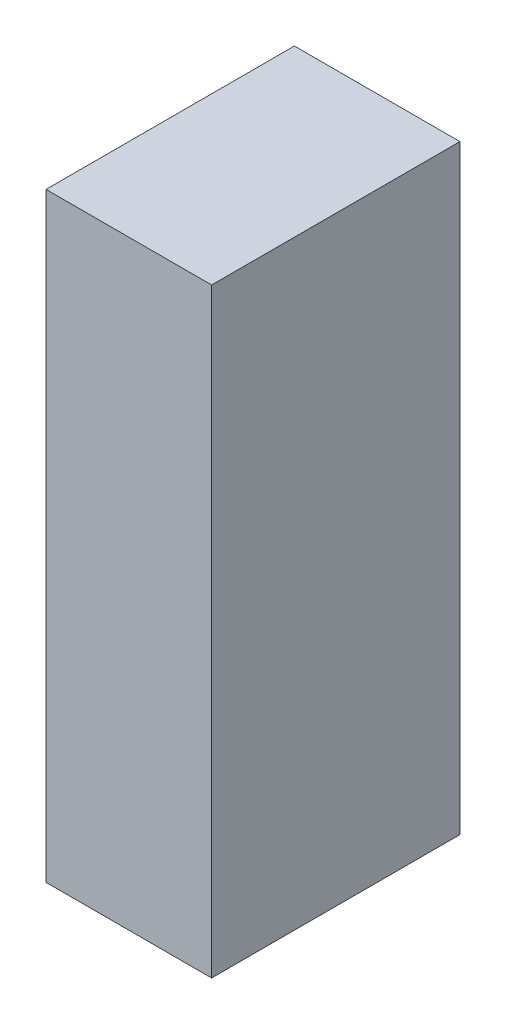
ISO-10303-21;
HEADER;
FILE_DESCRIPTION(('STEP AP214'),'2;1');
FILE_NAME('part.step','',(''),(''),'','','');
FILE_SCHEMA(('AUTOMOTIVE_DESIGN { 1 0 10303 214 1 1 1 1 }'));
ENDSEC;
DATA;
#1=APPLICATION_CONTEXT('core data for automotive mechanical design processes');
#2=APPLICATION_PROTOCOL_DEFINITION('international standard','automotive_design',2000,#1);
#3=PRODUCT_CONTEXT('',#1,'mechanical');
#4=PRODUCT('Part','Part','',(#3));
#5=PRODUCT_RELATED_PRODUCT_CATEGORY('part','',(#4));
#6=PRODUCT_DEFINITION_FORMATION('','',#4);
#7=PRODUCT_DEFINITION_CONTEXT('part definition',#1,'design');
#8=PRODUCT_DEFINITION('design','',#6,#7);
#9=PRODUCT_DEFINITION_SHAPE('','',#8);
#10=(LENGTH_UNIT() NAMED_UNIT(*) SI_UNIT(.MILLI.,.METRE.));
#11=(NAMED_UNIT(*) PLANE_ANGLE_UNIT() SI_UNIT($,.RADIAN.));
#12=(NAMED_UNIT(*) SI_UNIT($,.STERADIAN.) SOLID_ANGLE_UNIT());
#13=UNCERTAINTY_MEASURE_WITH_UNIT(LENGTH_MEASURE(1.E-05),#10,'distance_accuracy_value','');
#14=(GEOMETRIC_REPRESENTATION_CONTEXT(3) GLOBAL_UNCERTAINTY_ASSIGNED_CONTEXT((#13)) GLOBAL_UNIT_ASSIGNED_CONTEXT((#10,
#11,#12)) REPRESENTATION_CONTEXT('',''));
#15=CARTESIAN_POINT('',(0.,0.,0.));
#16=DIRECTION('',(0.,0.,1.));
#17=DIRECTION('',(1.,0.,0.));
#18=AXIS2_PLACEMENT_3D('',#15,#16,#17);
#19=CARTESIAN_POINT('',(-1.10000728087265,0.725001661346113,0.));
#20=DIRECTION('',(-1.,4.37113882867379E-08,0.));
#21=DIRECTION('',(-4.37113882867379E-08,-1.,0.));
#22=AXIS2_PLACEMENT_3D('',#19,#20,#21);
#23=PLANE('',#22);
#24=DIRECTION('',(-4.37113883425931E-08,-0.999999999999999,0.));
#25=VECTOR('',#24,1.);
#26=CARTESIAN_POINT('',(-1.10000728087265,0.725001661346113,0.));
#27=LINE('',#26,#25);
#28=CARTESIAN_POINT('',(-1.10000728087265,0.725001661346113,0.));
#29=VERTEX_POINT('',#28);
#30=CARTESIAN_POINT('',(-1.10000734425402,-0.724995286896075,0.));
#31=VERTEX_POINT('',#30);
#32=EDGE_CURVE('E11',#29,#31,#27,.T.);
#33=ORIENTED_EDGE('',*,*,#32,.T.);
#34=DIRECTION('',(0.,0.,1.));
#35=VECTOR('',#34,1.);
#36=CARTESIAN_POINT('',(-1.10000734425403,-0.724995286896075,0.));
#37=LINE('',#36,#35);
#38=CARTESIAN_POINT('',(-1.10000734425402,-0.724995286896075,0.599998772144318));
#39=VERTEX_POINT('',#38);
#40=EDGE_CURVE('E88',#31,#39,#37,.T.);
#41=ORIENTED_EDGE('',*,*,#40,.T.);
#42=DIRECTION('',(-4.37113883425931E-08,-0.999999999999999,0.));
#43=VECTOR('',#42,1.);
#44=CARTESIAN_POINT('',(-1.10000728087265,0.725001661346113,0.599998772144318));
#45=LINE('',#44,#43);
#46=CARTESIAN_POINT('',(-1.10000728087265,0.725001661346113,0.599998772144318));
#47=VERTEX_POINT('',#46);
#48=EDGE_CURVE('E83',#47,#39,#45,.T.);
#49=ORIENTED_EDGE('',*,*,#48,.F.);
#50=DIRECTION('',(0.,0.,1.));
#51=VECTOR('',#50,1.);
#52=CARTESIAN_POINT('',(-1.10000728087265,0.725001661346125,0.));
#53=LINE('',#52,#51);
#54=EDGE_CURVE('E72',#29,#47,#53,.T.);
#55=ORIENTED_EDGE('',*,*,#54,.F.);
#56=EDGE_LOOP('',(#33,#41,#49,#55));
#57=FACE_BOUND('',#56,.T.);
#58=ADVANCED_FACE('F17',(#57),#23,.T.);
#59=CARTESIAN_POINT('',(-1.10000734425402,-0.724995286896075,0.));
#60=DIRECTION('',(-4.37113882867379E-08,-1.,0.));
#61=DIRECTION('',(1.,-4.37113882867379E-08,0.));
#62=AXIS2_PLACEMENT_3D('',#59,#60,#61);
#63=PLANE('',#62);
#64=DIRECTION('',(0.999999999999999,-4.37113881855009E-08,0.));
#65=VECTOR('',#64,1.);
#66=CARTESIAN_POINT('',(-1.10000734425402,-0.724995286896075,0.));
#67=LINE('',#66,#65);
#68=CARTESIAN_POINT('',(-0.700005818375118,-0.724995304380684,0.));
#69=VERTEX_POINT('',#68);
#70=EDGE_CURVE('E24',#31,#69,#67,.T.);
#71=ORIENTED_EDGE('',*,*,#70,.T.);
#72=DIRECTION('',(0.,0.,1.));
#73=VECTOR('',#72,1.);
#74=CARTESIAN_POINT('',(-0.700005818375118,-0.724995304380697,0.));
#75=LINE('',#74,#73);
#76=CARTESIAN_POINT('',(-0.700005818375118,-0.724995304380684,0.599998772144318));
#77=VERTEX_POINT('',#76);
#78=EDGE_CURVE('E85',#69,#77,#75,.T.);
#79=ORIENTED_EDGE('',*,*,#78,.T.);
#80=DIRECTION('',(0.999999999999999,-4.37113881855009E-08,0.));
#81=VECTOR('',#80,1.);
#82=CARTESIAN_POINT('',(-1.10000734425402,-0.724995286896075,0.599998772144318));
#83=LINE('',#82,#81);
#84=EDGE_CURVE('E66',#39,#77,#83,.T.);
#85=ORIENTED_EDGE('',*,*,#84,.F.);
#86=ORIENTED_EDGE('',*,*,#40,.F.);
#87=EDGE_LOOP('',(#71,#79,#85,#86));
#88=FACE_BOUND('',#87,.T.);
#89=ADVANCED_FACE('F89',(#88),#63,.T.);
#90=CARTESIAN_POINT('',(-0.700005818375118,-0.724995304380684,0.));
#91=DIRECTION('',(1.,-4.37113882867379E-08,0.));
#92=DIRECTION('',(4.37113882867379E-08,1.,0.));
#93=AXIS2_PLACEMENT_3D('',#90,#91,#92);
#94=PLANE('',#93);
#95=DIRECTION('',(4.37113882660258E-08,0.999999999999999,0.));
#96=VECTOR('',#95,1.);
#97=CARTESIAN_POINT('',(-0.700005818375118,-0.724995304380684,0.));
#98=LINE('',#97,#96);
#99=CARTESIAN_POINT('',(-0.70000575499374,0.725001643861503,0.));
#100=VERTEX_POINT('',#99);
#101=EDGE_CURVE('E62',#69,#100,#98,.T.);
#102=ORIENTED_EDGE('',*,*,#101,.T.);
#103=DIRECTION('',(0.,0.,1.));
#104=VECTOR('',#103,1.);
#105=CARTESIAN_POINT('',(-0.700005754993738,0.725001643861503,0.));
#106=LINE('',#105,#104);
#107=CARTESIAN_POINT('',(-0.70000575499374,0.725001643861503,0.599998772144318));
#108=VERTEX_POINT('',#107);
#109=EDGE_CURVE('E55',#100,#108,#106,.T.);
#110=ORIENTED_EDGE('',*,*,#109,.T.);
#111=DIRECTION('',(4.37113882660258E-08,0.999999999999999,0.));
#112=VECTOR('',#111,1.);
#113=CARTESIAN_POINT('',(-0.700005818375118,-0.724995304380684,0.599998772144318));
#114=LINE('',#113,#112);
#115=EDGE_CURVE('E59',#77,#108,#114,.T.);
#116=ORIENTED_EDGE('',*,*,#115,.F.);
#117=ORIENTED_EDGE('',*,*,#78,.F.);
#118=EDGE_LOOP('',(#102,#110,#116,#117));
#119=FACE_BOUND('',#118,.T.);
#120=ADVANCED_FACE('F57',(#119),#94,.T.);
#121=CARTESIAN_POINT('',(-0.70000575499374,0.725001643861503,0.));
#122=DIRECTION('',(4.37113882867379E-08,1.,0.));
#123=DIRECTION('',(-1.,4.37113882867379E-08,0.));
#124=AXIS2_PLACEMENT_3D('',#121,#122,#123);
#125=PLANE('',#124);
#126=DIRECTION('',(-0.999999999999999,4.37113881855009E-08,0.));
#127=VECTOR('',#126,1.);
#128=CARTESIAN_POINT('',(-0.70000575499374,0.725001643861503,0.));
#129=LINE('',#128,#127);
#130=EDGE_CURVE('E65',#100,#29,#129,.T.);
#131=ORIENTED_EDGE('',*,*,#130,.T.);
#132=ORIENTED_EDGE('',*,*,#54,.T.);
#133=DIRECTION('',(-0.999999999999999,4.37113881855009E-08,0.));
#134=VECTOR('',#133,1.);
#135=CARTESIAN_POINT('',(-0.70000575499374,0.725001643861503,0.599998772144318));
#136=LINE('',#135,#134);
#137=EDGE_CURVE('E70',#108,#47,#136,.T.);
#138=ORIENTED_EDGE('',*,*,#137,.F.);
#139=ORIENTED_EDGE('',*,*,#109,.F.);
#140=EDGE_LOOP('',(#131,#132,#138,#139));
#141=FACE_BOUND('',#140,.T.);
#142=ADVANCED_FACE('F71',(#141),#125,.T.);
#143=CARTESIAN_POINT('',(-102.724990844727,202.199996948242,0.599998772144318));
#144=DIRECTION('',(0.,0.,1.));
#145=DIRECTION('',(-4.37113882867379E-08,-1.,0.));
#146=AXIS2_PLACEMENT_3D('',#143,#144,#145);
#147=PLANE('',#146);
#148=ORIENTED_EDGE('',*,*,#48,.T.);
#149=ORIENTED_EDGE('',*,*,#84,.T.);
#150=ORIENTED_EDGE('',*,*,#115,.T.);
#151=ORIENTED_EDGE('',*,*,#137,.T.);
#152=EDGE_LOOP('',(#148,#149,#150,#151));
#153=FACE_BOUND('',#152,.T.);
#154=ADVANCED_FACE('F76',(#153),#147,.T.);
#155=CARTESIAN_POINT('',(-102.724990844727,202.199996948242,0.));
#156=DIRECTION('',(0.,0.,1.));
#157=DIRECTION('',(-4.37113882867379E-08,-1.,0.));
#158=AXIS2_PLACEMENT_3D('',#155,#156,#157);
#159=PLANE('',#158);
#160=ORIENTED_EDGE('',*,*,#130,.F.);
#161=ORIENTED_EDGE('',*,*,#101,.F.);
#162=ORIENTED_EDGE('',*,*,#70,.F.);
#163=ORIENTED_EDGE('',*,*,#32,.F.);
#164=EDGE_LOOP('',(#160,#161,#162,#163));
#165=FACE_BOUND('',#164,.T.);
#166=ADVANCED_FACE('F91',(#165),#159,.F.);
#167=CLOSED_SHELL('',(#58,#89,#120,#142,#154,#166));
#168=MANIFOLD_SOLID_BREP('B1',#167);
#169=ADVANCED_BREP_SHAPE_REPRESENTATION('',(#18,#168),#14);
#170=SHAPE_DEFINITION_REPRESENTATION(#9,#169);
ENDSEC;
END-ISO-10303-21;
